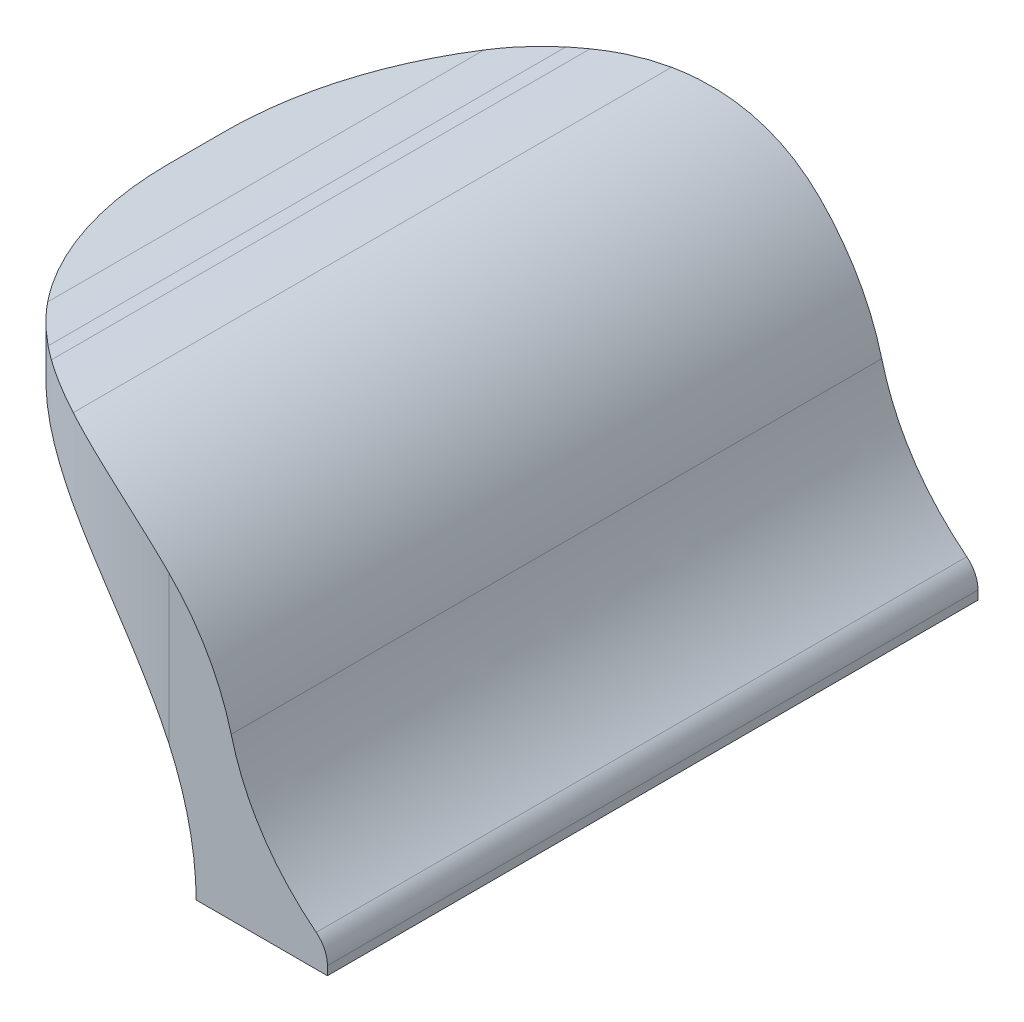
ISO-10303-21;
HEADER;
FILE_DESCRIPTION(('STEP AP214'),'2;1');
FILE_NAME('part.step','',(''),(''),'','','');
FILE_SCHEMA(('AUTOMOTIVE_DESIGN { 1 0 10303 214 1 1 1 1 }'));
ENDSEC;
DATA;
#1=APPLICATION_CONTEXT('core data for automotive mechanical design processes');
#2=APPLICATION_PROTOCOL_DEFINITION('international standard','automotive_design',2000,#1);
#3=PRODUCT_CONTEXT('',#1,'mechanical');
#4=PRODUCT('Part','Part','',(#3));
#5=PRODUCT_RELATED_PRODUCT_CATEGORY('part','',(#4));
#6=PRODUCT_DEFINITION_FORMATION('','',#4);
#7=PRODUCT_DEFINITION_CONTEXT('part definition',#1,'design');
#8=PRODUCT_DEFINITION('design','',#6,#7);
#9=PRODUCT_DEFINITION_SHAPE('','',#8);
#10=(LENGTH_UNIT() NAMED_UNIT(*) SI_UNIT(.MILLI.,.METRE.));
#11=(NAMED_UNIT(*) PLANE_ANGLE_UNIT() SI_UNIT($,.RADIAN.));
#12=(NAMED_UNIT(*) SI_UNIT($,.STERADIAN.) SOLID_ANGLE_UNIT());
#13=UNCERTAINTY_MEASURE_WITH_UNIT(LENGTH_MEASURE(1.E-05),#10,'distance_accuracy_value','');
#14=(GEOMETRIC_REPRESENTATION_CONTEXT(3) GLOBAL_UNCERTAINTY_ASSIGNED_CONTEXT((#13)) GLOBAL_UNIT_ASSIGNED_CONTEXT((#10,
#11,#12)) REPRESENTATION_CONTEXT('',''));
#15=CARTESIAN_POINT('',(0.,0.,0.));
#16=DIRECTION('',(0.,0.,1.));
#17=DIRECTION('',(1.,0.,0.));
#18=AXIS2_PLACEMENT_3D('',#15,#16,#17);
#19=CARTESIAN_POINT('',(19.2,114.3,9.53749999999998));
#20=DIRECTION('',(0.,1.,0.));
#21=DIRECTION('',(0.,0.,1.));
#22=AXIS2_PLACEMENT_3D('',#19,#20,#21);
#23=CYLINDRICAL_SURFACE('',#22,100.);
#24=CARTESIAN_POINT('',(19.2,124.098027477098,9.53749999999998));
#25=DIRECTION('',(-0.138620474093435,0.990345578150431,0.));
#26=DIRECTION('',(0.990345578150431,0.138620474093435,0.));
#27=AXIS2_PLACEMENT_3D('',#24,#25,#26);
#28=ELLIPSE('',#27,100.974853835123,100.);
#29=CARTESIAN_POINT('',(-80.8,110.100845366958,9.53749999999998));
#30=VERTEX_POINT('',#29);
#31=CARTESIAN_POINT('',(-57.6974039014432,113.334557815043,73.465500697803));
#32=VERTEX_POINT('',#31);
#33=EDGE_CURVE('E281',#30,#32,#28,.T.);
#34=ORIENTED_EDGE('',*,*,#33,.F.);
#35=DIRECTION('',(0.,-1.,0.));
#36=VECTOR('',#35,1.);
#37=CARTESIAN_POINT('',(-80.8,114.3,9.53749999999998));
#38=LINE('',#37,#36);
#39=CARTESIAN_POINT('',(-80.8,99.100845366958,9.53749999999998));
#40=VERTEX_POINT('',#39);
#41=EDGE_CURVE('E11',#40,#30,#38,.F.);
#42=ORIENTED_EDGE('',*,*,#41,.F.);
#43=CARTESIAN_POINT('',(19.2,99.100845366958,9.53749999999998));
#44=DIRECTION('',(0.,-1.,0.));
#45=DIRECTION('',(0.,0.,-1.));
#46=AXIS2_PLACEMENT_3D('',#43,#44,#45);
#47=CIRCLE('',#46,100.);
#48=CARTESIAN_POINT('',(-71.5919939481185,99.100845366958,51.4518631100941));
#49=VERTEX_POINT('',#48);
#50=EDGE_CURVE('E44',#49,#40,#47,.T.);
#51=ORIENTED_EDGE('',*,*,#50,.F.);
#52=CARTESIAN_POINT('',(19.2,41.0152084770521,109.5375));
#53=CARTESIAN_POINT('',(18.6741614627592,42.1542794539778,109.53747997094));
#54=CARTESIAN_POINT('',(18.1268527548087,43.2834582511904,109.53335178876));
#55=CARTESIAN_POINT('',(16.9901572620319,45.5204076394609,109.514701338181));
#56=CARTESIAN_POINT('',(16.4007685830404,46.6281772639623,109.500178601621));
#57=CARTESIAN_POINT('',(15.1805095562629,48.8211447425887,109.458550180805));
#58=CARTESIAN_POINT('',(14.5496180520067,49.9063307076043,109.43143803564));
#59=CARTESIAN_POINT('',(13.2476613297056,52.0518356797781,109.362320010504));
#60=CARTESIAN_POINT('',(12.5765965944647,53.112154985572,109.320314309495));
#61=CARTESIAN_POINT('',(11.1917222995404,55.2118645596623,109.218752433033));
#62=CARTESIAN_POINT('',(10.4777021741459,56.2511115192924,109.159103041211));
#63=CARTESIAN_POINT('',(9.01154915749051,58.3009863437433,109.019848664445));
#64=CARTESIAN_POINT('',(8.25941671514355,59.3116145454377,108.940243914505));
#65=CARTESIAN_POINT('',(6.71864601943419,61.3023539235825,108.758553387719));
#66=CARTESIAN_POINT('',(5.93001300016434,62.2824694419687,108.656470826294));
#67=CARTESIAN_POINT('',(4.31784811964813,64.2105604677322,108.427258972349));
#68=CARTESIAN_POINT('',(3.49431628523086,65.1585359998167,108.300129699083));
#69=CARTESIAN_POINT('',(1.81025953279753,67.0250433673817,108.017596185814));
#70=CARTESIAN_POINT('',(0.94957637027193,67.943412492772,107.86205947873));
#71=CARTESIAN_POINT('',(-0.802869811770035,69.7441629288867,107.520570380327));
#72=CARTESIAN_POINT('',(-1.69463287053923,70.6265441941566,107.334617950594));
#73=CARTESIAN_POINT('',(-3.50682240218988,72.3536694318312,106.929810806055));
#74=CARTESIAN_POINT('',(-4.4272507707138,73.1984109060919,106.710953911593));
#75=CARTESIAN_POINT('',(-6.29395581773209,74.8485719400711,106.237992412554));
#76=CARTESIAN_POINT('',(-7.24023240667354,75.6539916359957,105.983887930083));
#77=CARTESIAN_POINT('',(-9.15253958530255,77.2215093738131,105.439109584407));
#78=CARTESIAN_POINT('',(-10.118497477708,77.9837374936357,105.148555041224));
#79=CARTESIAN_POINT('',(-12.0698031852912,79.4663242553597,104.528275544874));
#80=CARTESIAN_POINT('',(-13.0551510969802,80.1866826887896,104.1985503967));
#81=CARTESIAN_POINT('',(-15.0415850588291,81.5843342858679,103.498251314142));
#82=CARTESIAN_POINT('',(-16.0426693919297,82.2616321078925,103.127681810274));
#83=CARTESIAN_POINT('',(-18.0569102078269,83.5723701492267,102.344235969684));
#84=CARTESIAN_POINT('',(-19.0700663891014,84.2058114612732,101.931360687697));
#85=CARTESIAN_POINT('',(-21.0087724998074,85.3707335663809,101.103098599629));
#86=CARTESIAN_POINT('',(-21.9335945874591,85.9061997941719,100.691604281624));
#87=CARTESIAN_POINT('',(-23.7868984710662,86.9404655998307,99.8324041135574));
#88=CARTESIAN_POINT('',(-24.7153801905512,87.43926593962,99.3846990163671));
#89=CARTESIAN_POINT('',(-26.5729027592415,88.4002006544621,98.4527464291365));
#90=CARTESIAN_POINT('',(-27.5019435772543,88.8623369128388,97.9685008185693));
#91=CARTESIAN_POINT('',(-29.3575685993916,89.7502317961565,96.9633311211311));
#92=CARTESIAN_POINT('',(-30.284152791524,90.1759902438355,96.4424068555548));
#93=CARTESIAN_POINT('',(-32.1321689148442,90.9917741168792,95.3637984252435));
#94=CARTESIAN_POINT('',(-33.0535987744152,91.3817860256651,94.806100491481));
#95=CARTESIAN_POINT('',(-34.8879847124428,92.1266249822243,93.6544585786707));
#96=CARTESIAN_POINT('',(-35.8009407766555,92.4814519708642,93.0605145387087));
#97=CARTESIAN_POINT('',(-37.6154999708213,93.1568663610931,91.8369314046915));
#98=CARTESIAN_POINT('',(-38.5171032295565,93.4774541513885,91.2072927159905));
#99=CARTESIAN_POINT('',(-40.3062319904975,94.0855483309866,89.9130394595691));
#100=CARTESIAN_POINT('',(-41.1937576257753,94.3730550331563,89.2484252227196));
#101=CARTESIAN_POINT('',(-42.90201474054,94.9008354879344,87.9239807249739));
#102=CARTESIAN_POINT('',(-43.7236690415266,95.142867776701,87.2660389138612));
#103=CARTESIAN_POINT('',(-45.3502359468801,95.5999846025013,85.9206204341985));
#104=CARTESIAN_POINT('',(-46.1551471323715,95.8150668633833,85.2331412775526));
#105=CARTESIAN_POINT('',(-47.7461720753239,96.2195895060928,83.8297280183304));
#106=CARTESIAN_POINT('',(-48.5322884232256,96.409033438551,83.1137978737096));
#107=CARTESIAN_POINT('',(-50.0841867503973,96.7637751813982,81.6543232096363));
#108=CARTESIAN_POINT('',(-50.8499669829841,96.9290709231355,80.910776331235));
#109=CARTESIAN_POINT('',(-52.3604109699794,97.2371842323039,79.3963052137768));
#110=CARTESIAN_POINT('',(-53.1050496540412,97.3799759574455,78.6253507281986));
#111=CARTESIAN_POINT('',(-54.570922851028,97.6444290220283,77.0578856878691));
#112=CARTESIAN_POINT('',(-55.2921555262755,97.7660887055763,76.2613731361927));
#113=CARTESIAN_POINT('',(-56.7098188695728,97.9898528914583,74.643995511682));
#114=CARTESIAN_POINT('',(-57.4062509550814,98.0919585128547,73.8231318355491));
#115=CARTESIAN_POINT('',(-58.7732406314476,98.2782392524911,72.1580570634366));
#116=CARTESIAN_POINT('',(-59.4437960741212,98.3624128846938,71.3138440390242));
#117=CARTESIAN_POINT('',(-60.8257957911845,98.5222794506484,69.5148951823825));
#118=CARTESIAN_POINT('',(-61.5343105270583,98.5961986687626,68.5577494951531));
#119=CARTESIAN_POINT('',(-62.9172393641279,98.7262990301502,66.6179511833568));
#120=CARTESIAN_POINT('',(-63.5916528447806,98.7824798507342,65.6352980951219));
#121=CARTESIAN_POINT('',(-64.9053805654351,98.8792153150163,63.6457826759724));
#122=CARTESIAN_POINT('',(-65.5446878947333,98.9197668914608,62.6389156341955));
#123=CARTESIAN_POINT('',(-66.787019785817,98.9872768356138,60.6027008630641));
#124=CARTESIAN_POINT('',(-67.3900468809774,99.0142361534145,59.5733547102374));
#125=CARTESIAN_POINT('',(-68.5574000088862,99.0564928945793,57.4963786858046));
#126=CARTESIAN_POINT('',(-69.1218261833697,99.0718216231246,56.4488057144003));
#127=CARTESIAN_POINT('',(-70.2129746455558,99.0928250774471,54.3341032918737));
#128=CARTESIAN_POINT('',(-70.7396966220015,99.0984997235363,53.2669736793983));
#129=CARTESIAN_POINT('',(-71.7545224539959,99.1020015538222,51.1150102387425));
#130=CARTESIAN_POINT('',(-72.2426413304929,99.0998318058762,50.0301834969224));
#131=CARTESIAN_POINT('',(-73.1798550446577,99.0893312353444,47.8438636190131));
#132=CARTESIAN_POINT('',(-73.6289509072217,99.0810005746229,46.7423709215295));
#133=CARTESIAN_POINT('',(-74.0582309006866,99.0704291176858,45.633238935146));
#134=B_SPLINE_CURVE_WITH_KNOTS('',3,(#52,#53,#54,#55,#56,#57,#58,#59,#60,#61,#62,#63,#64,#65,
#66,#67,#68,#69,#70,#71,#72,#73,#74,#75,#76,#77,#78,#79,#80,#81,#82,#83,#84,#85,#86,#87,#88,#89,
#90,#91,#92,#93,#94,#95,#96,#97,#98,#99,#100,#101,#102,#103,#104,#105,#106,#107,#108,#109,#110,
#111,#112,#113,#114,#115,#116,#117,#118,#119,#120,#121,#122,#123,#124,#125,#126,#127,#128,#129,
#130,#131,#132,#133),.UNSPECIFIED.,.F.,.F.,(4,2,2,2,2,2,2,2,2,2,2,2,2,2,2,2,2,2,2,2,2,2,2,2,2,2,
2,2,2,2,2,2,2,2,2,2,2,2,2,2,4),(0.,3.76355913018099,7.52728777811852,11.2929501176447,
15.0585672103232,18.8444456679216,22.6302795431078,26.4155722109432,30.2008619688206,
34.0042758301461,37.8076944952249,41.6113652174396,45.4150227632515,49.206538882553,
52.9980738784048,56.7891979986187,60.5802276244675,64.0145108951434,67.4487227808184,
70.8827581469592,74.3168102455319,77.7521555260586,81.1875065800898,84.622818629539,
88.0580981865549,91.2974794857448,94.5371341932131,97.7763397834937,101.015822697412,
104.258998955316,107.502429231898,110.745673834199,113.989187102107,117.567686571273,
121.146251135228,124.72551763861,128.304533918311,131.873882316756,135.443260177593,
139.011242244569,142.579130574109),.UNSPECIFIED.);
#135=CARTESIAN_POINT('',(19.2,41.0152084770521,109.5375));
#136=VERTEX_POINT('',#135);
#137=EDGE_CURVE('E257',#136,#49,#134,.T.);
#138=ORIENTED_EDGE('',*,*,#137,.F.);
#139=DIRECTION('',(0.,-1.,0.));
#140=VECTOR('',#139,1.);
#141=CARTESIAN_POINT('',(19.2,114.3,109.5375));
#142=LINE('',#141,#140);
#143=CARTESIAN_POINT('',(19.2,90.7791078814102,109.5375));
#144=VERTEX_POINT('',#143);
#145=EDGE_CURVE('E255',#144,#136,#142,.T.);
#146=ORIENTED_EDGE('',*,*,#145,.F.);
#147=CARTESIAN_POINT('',(19.2,90.7791078814102,109.5375));
#148=CARTESIAN_POINT('',(18.5202130921273,91.4565480266134,109.537504338115));
#149=CARTESIAN_POINT('',(17.8281979120944,92.1217511660535,109.530568487855));
#150=CARTESIAN_POINT('',(16.4208211667763,93.4267223665309,109.501350265641));
#151=CARTESIAN_POINT('',(15.705458076879,94.0664887604803,109.479066889579));
#152=CARTESIAN_POINT('',(14.2522479220946,95.3198271470562,109.417672848988));
#153=CARTESIAN_POINT('',(13.5143905803734,95.9333868498473,109.378554382715));
#154=CARTESIAN_POINT('',(12.0178254140151,97.1330075314257,109.282066679499));
#155=CARTESIAN_POINT('',(11.2591180113959,97.7190690661433,109.224697811707));
#156=CARTESIAN_POINT('',(9.72420741903608,98.8613120065329,109.090507595863));
#157=CARTESIAN_POINT('',(8.94805359521714,99.4175655666971,109.013736056588));
#158=CARTESIAN_POINT('',(7.37793366007412,100.500902648724,108.839376323395));
#159=CARTESIAN_POINT('',(6.58396773495534,101.027986475323,108.741788346997));
#160=CARTESIAN_POINT('',(4.98000791938419,102.052085884851,108.524603487627));
#161=CARTESIAN_POINT('',(4.17001683848171,102.549106677548,108.405010432623));
#162=CARTESIAN_POINT('',(2.53564535381388,103.512447981124,108.142693886054));
#163=CARTESIAN_POINT('',(1.71126496572333,103.978768525443,107.999970419683));
#164=CARTESIAN_POINT('',(0.0463180173828398,104.882076307237,107.689711862605));
#165=CARTESIAN_POINT('',(-0.794304042092636,105.318924548869,107.522069729253));
#166=CARTESIAN_POINT('',(-2.48615986171945,106.160497411484,107.161567423515));
#167=CARTESIAN_POINT('',(-3.33739363414582,106.565221995305,106.968707221956));
#168=CARTESIAN_POINT('',(-5.04845147055286,107.342199518451,106.557018407651));
#169=CARTESIAN_POINT('',(-5.90827624137656,107.714449760948,106.338187641735));
#170=CARTESIAN_POINT('',(-7.63429040364435,108.42621171548,105.873990991297));
#171=CARTESIAN_POINT('',(-8.50047978842307,108.765723461797,105.628625134559));
#172=CARTESIAN_POINT('',(-10.2370716024451,109.411957593196,105.110926155075));
#173=CARTESIAN_POINT('',(-11.1074742304076,109.718678415616,104.838591748325));
#174=CARTESIAN_POINT('',(-12.8502504925608,110.299416656361,104.266706276425));
#175=CARTESIAN_POINT('',(-13.7226241385525,110.573433878349,103.967155047898));
#176=CARTESIAN_POINT('',(-15.4670500760482,111.089009797836,103.340774960664));
#177=CARTESIAN_POINT('',(-16.3391023921306,111.33057200929,103.01394906125));
#178=CARTESIAN_POINT('',(-18.0808270798955,111.781717457768,102.333050637281));
#179=CARTESIAN_POINT('',(-18.9504994714846,111.991300963082,101.978978341352));
#180=CARTESIAN_POINT('',(-20.6475922124841,112.370654521411,101.259805757761));
#181=CARTESIAN_POINT('',(-21.4752029033705,112.541761154495,100.895857663612));
#182=CARTESIAN_POINT('',(-23.1246873263136,112.855967562667,100.14347461573));
#183=CARTESIAN_POINT('',(-23.9465604811957,112.99906455815,99.7550372367961));
#184=CARTESIAN_POINT('',(-25.5829137931433,113.258031539679,98.9540562807618));
#185=CARTESIAN_POINT('',(-26.3973931736628,113.373898696948,98.5415102046782));
#186=CARTESIAN_POINT('',(-28.0173301864604,113.579285364937,97.6928167515513));
#187=CARTESIAN_POINT('',(-28.8227877150865,113.668804573245,97.2566691036846));
#188=CARTESIAN_POINT('',(-30.424586655763,113.822615523785,96.3605615480659));
#189=CARTESIAN_POINT('',(-31.220910301923,113.886864248328,95.9005625316468));
#190=CARTESIAN_POINT('',(-32.8017394063708,113.99099824805,94.9580246550681));
#191=CARTESIAN_POINT('',(-33.5862445818287,114.030882941069,94.47548525662));
#192=CARTESIAN_POINT('',(-35.1417971233366,114.08741552957,93.4887763346163));
#193=CARTESIAN_POINT('',(-35.9128512508498,114.104075452516,92.9846181463768));
#194=CARTESIAN_POINT('',(-37.4407905651472,114.115403513611,91.9551567177936));
#195=CARTESIAN_POINT('',(-38.1976769069697,114.110073452422,91.4298552122698));
#196=CARTESIAN_POINT('',(-38.9469787750804,114.094352770222,90.8942997117042));
#197=B_SPLINE_CURVE_WITH_KNOTS('',3,(#147,#148,#149,#150,#151,#152,#153,#154,#155,#156,#157,
#158,#159,#160,#161,#162,#163,#164,#165,#166,#167,#168,#169,#170,#171,#172,#173,#174,#175,#176,
#177,#178,#179,#180,#181,#182,#183,#184,#185,#186,#187,#188,#189,#190,#191,#192,#193,#194,#195,
#196),.UNSPECIFIED.,.F.,.F.,(4,2,2,2,2,2,2,2,2,2,2,2,2,2,2,2,2,2,2,2,2,2,2,2,4),(0.,
2.87897258839763,5.75813355055138,8.63863021703896,11.5190686234211,14.3921864335047,
17.2652742223844,20.1378626850598,23.0104480187148,25.8957501323167,28.7810555837839,
31.666600417589,34.5521422299254,37.4378214924114,40.3235180783373,43.2089019731876,
46.0942616592412,48.853937050891,51.6138861668529,54.3741218741319,57.134389261301,
59.8993352954738,62.6643473933107,65.4279270356691,68.191280385326),.UNSPECIFIED.);
#198=CARTESIAN_POINT('',(-21.8276742008499,112.607430583888,100.733607097117));
#199=VERTEX_POINT('',#198);
#200=EDGE_CURVE('E246',#199,#144,#197,.F.);
#201=ORIENTED_EDGE('',*,*,#200,.F.);
#202=CARTESIAN_POINT('',(-21.8276742008499,112.607430583888,100.733607097117));
#203=CARTESIAN_POINT('',(-22.356148031028,112.711395974344,100.495856767829));
#204=CARTESIAN_POINT('',(-22.8833763571514,112.810186244688,100.253139615465));
#205=CARTESIAN_POINT('',(-23.9349908983102,112.997602729697,99.757843213585));
#206=CARTESIAN_POINT('',(-24.4593771525639,113.086229084958,99.5052641005533));
#207=CARTESIAN_POINT('',(-26.0275673711589,113.337113537106,98.7329299035892));
#208=CARTESIAN_POINT('',(-27.0666059165291,113.484416784093,98.1984866451902));
#209=CARTESIAN_POINT('',(-29.1204513584453,113.739728403422,97.0959466850743));
#210=CARTESIAN_POINT('',(-30.1353867922064,113.848047572927,96.5281601348855));
#211=CARTESIAN_POINT('',(-32.1471940707358,114.028913580401,95.3560349641487));
#212=CARTESIAN_POINT('',(-33.1440656374582,114.101459868189,94.7516957815884));
#213=CARTESIAN_POINT('',(-35.1171375394895,114.212771062521,93.5077826345133));
#214=CARTESIAN_POINT('',(-36.0933428330555,114.251544163646,92.8682172571977));
#215=CARTESIAN_POINT('',(-38.023285833471,114.29748398051,91.5549253798686));
#216=CARTESIAN_POINT('',(-38.9770227990084,114.304649654853,90.8811977550232));
#217=CARTESIAN_POINT('',(-40.8679358433454,114.289550679003,89.4951656745019));
#218=CARTESIAN_POINT('',(-41.8049094869224,114.267041923505,88.782588056432));
#219=CARTESIAN_POINT('',(-43.6523760557229,114.194556870401,87.3254429202009));
#220=CARTESIAN_POINT('',(-44.562872208469,114.144583935496,86.5808793286715));
#221=CARTESIAN_POINT('',(-45.4593840838378,114.082070096935,85.8209454511511));
#222=B_SPLINE_CURVE_WITH_KNOTS('',3,(#202,#203,#204,#205,#206,#207,#208,#209,#210,#211,#212,
#213,#214,#215,#216,#217,#218,#219,#220,#221),.UNSPECIFIED.,.F.,.F.,(4,2,2,2,2,2,2,2,2,4),(0.,
1.76613412398454,3.53224381438137,7.06378524185359,10.566513191129,14.0692950100382,
17.571226691956,21.0732737540233,24.6043095823433,28.1349131688141),.UNSPECIFIED.);
#223=CARTESIAN_POINT('',(-39.2,114.3,90.7128657213812));
#224=VERTEX_POINT('',#223);
#225=EDGE_CURVE('E238',#224,#199,#222,.F.);
#226=ORIENTED_EDGE('',*,*,#225,.F.);
#227=CARTESIAN_POINT('',(19.2,114.3,9.53749999999998));
#228=DIRECTION('',(0.,1.,0.));
#229=DIRECTION('',(0.,0.,1.));
#230=AXIS2_PLACEMENT_3D('',#227,#228,#229);
#231=CIRCLE('',#230,100.);
#232=CARTESIAN_POINT('',(-43.8353564920997,114.3,87.1683175399042));
#233=VERTEX_POINT('',#232);
#234=EDGE_CURVE('E247',#233,#224,#231,.T.);
#235=ORIENTED_EDGE('',*,*,#234,.F.);
#236=CARTESIAN_POINT('',(-43.8353564920997,114.3,87.1683175399042));
#237=CARTESIAN_POINT('',(-44.9065196832462,114.300010091943,86.2985890110179));
#238=CARTESIAN_POINT('',(-45.9595679937707,114.282790050415,85.4066975414454));
#239=CARTESIAN_POINT('',(-48.0272011154415,114.217453659481,83.5807547946442));
#240=CARTESIAN_POINT('',(-49.041791631594,114.169341911839,82.6467098160513));
#241=CARTESIAN_POINT('',(-51.0231305522016,114.046247736835,80.7455290112895));
#242=CARTESIAN_POINT('',(-51.990180936398,113.971469744342,79.7786942453767));
#243=CARTESIAN_POINT('',(-53.8828602423095,113.7984959842,77.8072785655958));
#244=CARTESIAN_POINT('',(-54.8084878830435,113.700299492937,76.8026964861726));
#245=CARTESIAN_POINT('',(-56.6166283386083,113.484010882362,74.7579048061169));
#246=CARTESIAN_POINT('',(-57.4991497350204,113.365922744071,73.717702367498));
#247=CARTESIAN_POINT('',(-59.2199943953511,113.11330468505,71.603292120494));
#248=CARTESIAN_POINT('',(-60.0583172169142,112.978774599809,70.5290839719394));
#249=CARTESIAN_POINT('',(-61.6958060004405,112.695630610092,68.3401434451207));
#250=CARTESIAN_POINT('',(-62.4946256820544,112.546917377193,67.2251650046771));
#251=CARTESIAN_POINT('',(-64.045117042995,112.239724693752,64.9642959176506));
#252=CARTESIAN_POINT('',(-64.7967915285674,112.081245825611,63.8184071167771));
#253=CARTESIAN_POINT('',(-65.5243933508917,111.919596803808,62.6579025899971));
#254=B_SPLINE_CURVE_WITH_KNOTS('',3,(#236,#237,#238,#239,#240,#241,#242,#243,#244,#245,#246,
#247,#248,#249,#250,#251,#252,#253),.UNSPECIFIED.,.F.,.F.,(4,2,2,2,2,2,2,2,4),(0.,
4.13883054569092,8.27704469599859,12.384192472281,16.4914671727625,20.5979208371334,
24.7044155926067,28.8421408081245,32.9796194976741),.UNSPECIFIED.);
#255=EDGE_CURVE('E350',#32,#233,#254,.F.);
#256=ORIENTED_EDGE('',*,*,#255,.F.);
#257=EDGE_LOOP('',(#34,#42,#51,#138,#146,#201,#226,#235,#256));
#258=FACE_BOUND('',#257,.T.);
#259=ADVANCED_FACE('F36',(#258),#23,.T.);
#260=CARTESIAN_POINT('',(19.2,114.3,-9.53750000000003));
#261=DIRECTION('',(0.,-1.,0.));
#262=DIRECTION('',(0.,0.,-1.));
#263=AXIS2_PLACEMENT_3D('',#260,#261,#262);
#264=CYLINDRICAL_SURFACE('',#263,100.);
#265=DIRECTION('',(0.,1.,0.));
#266=VECTOR('',#265,1.);
#267=CARTESIAN_POINT('',(19.2,114.3,-109.5375));
#268=LINE('',#267,#266);
#269=CARTESIAN_POINT('',(19.2,41.0152084770521,-109.5375));
#270=VERTEX_POINT('',#269);
#271=CARTESIAN_POINT('',(19.2,90.7791078814102,-109.5375));
#272=VERTEX_POINT('',#271);
#273=EDGE_CURVE('E334',#270,#272,#268,.T.);
#274=ORIENTED_EDGE('',*,*,#273,.F.);
#275=CARTESIAN_POINT('',(-71.5919939481185,99.100845366958,-51.4518631100942));
#276=CARTESIAN_POINT('',(-71.0661554108777,99.1008253378979,-52.5909340870199));
#277=CARTESIAN_POINT('',(-70.5188467029272,99.0966971557182,-53.7201128842325));
#278=CARTESIAN_POINT('',(-69.3821512101503,99.0780467051389,-55.957062272503));
#279=CARTESIAN_POINT('',(-68.7927625311589,99.0635239685786,-57.0648318970043));
#280=CARTESIAN_POINT('',(-67.5725035043813,99.0218955477632,-59.2577993756308));
#281=CARTESIAN_POINT('',(-66.9416120001252,98.9947834025982,-60.3429853406464));
#282=CARTESIAN_POINT('',(-65.6396552778241,98.925665377462,-62.4884903128202));
#283=CARTESIAN_POINT('',(-64.9685905425831,98.8836596764526,-63.5488096186141));
#284=CARTESIAN_POINT('',(-63.5837162476588,98.7820977999913,-65.6485191927043));
#285=CARTESIAN_POINT('',(-62.8696961222644,98.7224484081692,-66.6877661523345));
#286=CARTESIAN_POINT('',(-61.403543105609,98.5831940314027,-68.7376409767854));
#287=CARTESIAN_POINT('',(-60.651410663262,98.5035892814632,-69.7482691784798));
#288=CARTESIAN_POINT('',(-59.1106399675526,98.3218987546766,-71.7390085566246));
#289=CARTESIAN_POINT('',(-58.3220069482828,98.219816193252,-72.7191240750107));
#290=CARTESIAN_POINT('',(-56.7098420677666,97.9906043393068,-74.6472151007742));
#291=CARTESIAN_POINT('',(-55.8863102333493,97.8634750660411,-75.5951906328587));
#292=CARTESIAN_POINT('',(-54.2022534809159,97.5809415527725,-77.4616980004238));
#293=CARTESIAN_POINT('',(-53.3415703183903,97.4254048456875,-78.380067125814));
#294=CARTESIAN_POINT('',(-51.5891241363484,97.0839157472846,-80.1808175619287));
#295=CARTESIAN_POINT('',(-50.6973610775792,96.8979633175515,-81.0631988271987));
#296=CARTESIAN_POINT('',(-48.8851715459285,96.4931561730134,-82.7903240648733));
#297=CARTESIAN_POINT('',(-47.9647431774046,96.2742992785509,-83.6350655391339));
#298=CARTESIAN_POINT('',(-46.0980381303863,95.801337779512,-85.2852265731132));
#299=CARTESIAN_POINT('',(-45.1517615414449,95.5472332970407,-86.0906462690378));
#300=CARTESIAN_POINT('',(-43.2394543628159,95.0024549513649,-87.6581640068551));
#301=CARTESIAN_POINT('',(-42.2734964704104,94.7119004081821,-88.4203921266777));
#302=CARTESIAN_POINT('',(-40.3221907628273,94.0916209118323,-89.9029788884017));
#303=CARTESIAN_POINT('',(-39.3368428511382,93.7618957636576,-90.6233373218316));
#304=CARTESIAN_POINT('',(-37.3504088892893,93.0615966811002,-92.02098891891));
#305=CARTESIAN_POINT('',(-36.3493245561888,92.6910271772323,-92.6982867409345));
#306=CARTESIAN_POINT('',(-34.3350837402915,91.9075813366424,-94.0090247822688));
#307=CARTESIAN_POINT('',(-33.321927559017,91.4947060546551,-94.6424660943153));
#308=CARTESIAN_POINT('',(-31.383221448311,90.6664439665866,-95.8073881994229));
#309=CARTESIAN_POINT('',(-30.4583993606593,90.2549496485815,-96.3428544272139));
#310=CARTESIAN_POINT('',(-28.6050954770523,89.3957494805155,-97.3771202328727));
#311=CARTESIAN_POINT('',(-27.6766137575673,88.9480443833251,-97.875920572662));
#312=CARTESIAN_POINT('',(-25.8190911888769,88.0160917960945,-98.8368552875042));
#313=CARTESIAN_POINT('',(-24.8900503708641,87.5318461855273,-99.2989915458809));
#314=CARTESIAN_POINT('',(-23.0344253487269,86.5266764880892,-100.186886429199));
#315=CARTESIAN_POINT('',(-22.1078411565945,86.0057522225128,-100.612644876878));
#316=CARTESIAN_POINT('',(-20.2598250332742,84.9271437922015,-101.428428749921));
#317=CARTESIAN_POINT('',(-19.3383951737032,84.369445858439,-101.818440658707));
#318=CARTESIAN_POINT('',(-17.5040092356757,83.2178039456287,-102.563279615266));
#319=CARTESIAN_POINT('',(-16.5910531714629,82.6238599056666,-102.918106603906));
#320=CARTESIAN_POINT('',(-14.7764939772971,81.4002767716495,-103.593520994135));
#321=CARTESIAN_POINT('',(-13.874890718562,80.7706380829485,-103.914108784431));
#322=CARTESIAN_POINT('',(-12.0857619576209,79.4763848265271,-104.522202964029));
#323=CARTESIAN_POINT('',(-11.1982363223432,78.8117705896776,-104.809709666198));
#324=CARTESIAN_POINT('',(-9.48997920757842,77.4873260919319,-105.337490120976));
#325=CARTESIAN_POINT('',(-8.66832490659188,76.8293842808192,-105.579522409743));
#326=CARTESIAN_POINT('',(-7.04175800123838,75.4839658011565,-106.036639235543));
#327=CARTESIAN_POINT('',(-6.23684681574699,74.7964866445106,-106.251721496425));
#328=CARTESIAN_POINT('',(-4.6458218727945,73.3930733852884,-106.656244139135));
#329=CARTESIAN_POINT('',(-3.85970552489286,72.6771432406676,-106.845688071593));
#330=CARTESIAN_POINT('',(-2.30780719772119,71.2176685765943,-107.20042981444));
#331=CARTESIAN_POINT('',(-1.54202696513431,70.474121698193,-107.365725556178));
#332=CARTESIAN_POINT('',(-0.0315829781390652,68.9596505807347,-107.673838865346));
#333=CARTESIAN_POINT('',(0.713055705922775,68.1886960951566,-107.816630590488));
#334=CARTESIAN_POINT('',(2.17892890290955,66.6212310548271,-108.08108365507));
#335=CARTESIAN_POINT('',(2.90016157815708,65.8247185031507,-108.202743338618));
#336=CARTESIAN_POINT('',(4.31782492145438,64.2073408786401,-108.4265075245));
#337=CARTESIAN_POINT('',(5.01425700696295,63.3864772025071,-108.528613145897));
#338=CARTESIAN_POINT('',(6.38124668332918,61.7214024303946,-108.714893885533));
#339=CARTESIAN_POINT('',(7.05180212600274,60.8771894059822,-108.799067517736));
#340=CARTESIAN_POINT('',(8.43380184306606,59.0782405493405,-108.95893408369));
#341=CARTESIAN_POINT('',(9.14231657893989,58.1210948621111,-109.032853301805));
#342=CARTESIAN_POINT('',(10.5252454160094,56.1812965503148,-109.162953663192));
#343=CARTESIAN_POINT('',(11.1996588966622,55.1986434620799,-109.219134483776));
#344=CARTESIAN_POINT('',(12.5133866173166,53.2091280429304,-109.315869948058));
#345=CARTESIAN_POINT('',(13.1526939466149,52.2022610011536,-109.356421524503));
#346=CARTESIAN_POINT('',(14.3950258376986,50.1660462300221,-109.423931468656));
#347=CARTESIAN_POINT('',(14.9980529328589,49.1367000771954,-109.450890786457));
#348=CARTESIAN_POINT('',(16.1654060607678,47.0597240527626,-109.493147527621));
#349=CARTESIAN_POINT('',(16.7298322352513,46.0121510813583,-109.508476256167));
#350=CARTESIAN_POINT('',(17.8209806974374,43.8974486588317,-109.529479710489));
#351=CARTESIAN_POINT('',(18.3477026738831,42.8303190463563,-109.535154356578));
#352=CARTESIAN_POINT('',(19.3625285058775,40.6783556057005,-109.538656186864));
#353=CARTESIAN_POINT('',(19.8506473823744,39.5935288638804,-109.536486438918));
#354=CARTESIAN_POINT('',(20.7878610965392,37.4072089859711,-109.525985868386));
#355=CARTESIAN_POINT('',(21.2369569591032,36.3057162884875,-109.517655207665));
#356=CARTESIAN_POINT('',(21.6662369525682,35.196584302104,-109.507083750728));
#357=B_SPLINE_CURVE_WITH_KNOTS('',3,(#275,#276,#277,#278,#279,#280,#281,#282,#283,#284,#285,
#286,#287,#288,#289,#290,#291,#292,#293,#294,#295,#296,#297,#298,#299,#300,#301,#302,#303,#304,
#305,#306,#307,#308,#309,#310,#311,#312,#313,#314,#315,#316,#317,#318,#319,#320,#321,#322,#323,
#324,#325,#326,#327,#328,#329,#330,#331,#332,#333,#334,#335,#336,#337,#338,#339,#340,#341,#342,
#343,#344,#345,#346,#347,#348,#349,#350,#351,#352,#353,#354,#355,#356),.UNSPECIFIED.,.F.,.F.,(4,
2,2,2,2,2,2,2,2,2,2,2,2,2,2,2,2,2,2,2,2,2,2,2,2,2,2,2,2,2,2,2,2,2,2,2,2,2,2,2,4),(0.,
3.76355913018099,7.52728777811853,11.2929501176447,15.0585672103231,18.8444456679216,
22.6302795431078,26.4155722109432,30.2008619688206,34.0042758301461,37.8076944952249,
41.6113652174397,45.4150227632515,49.2065388825529,52.9980738784048,56.7891979986187,
60.5802276244675,64.0145108951434,67.4487227808184,70.8827581469591,74.3168102455319,
77.7521555260586,81.1875065800897,84.6228186295389,88.0580981865549,91.2974794857448,
94.537134193213,97.7763397834936,101.015822697412,104.258998955316,107.502429231898,
110.745673834199,113.989187102107,117.567686571273,121.146251135227,124.72551763861,
128.304533918311,131.873882316756,135.443260177593,139.011242244569,142.579130574109),.UNSPECIFIED.);
#358=CARTESIAN_POINT('',(-71.5919939481185,99.100845366958,-51.4518631100942));
#359=VERTEX_POINT('',#358);
#360=EDGE_CURVE('E274',#359,#270,#357,.T.);
#361=ORIENTED_EDGE('',*,*,#360,.F.);
#362=CARTESIAN_POINT('',(19.2,99.100845366958,-9.53750000000003));
#363=DIRECTION('',(0.,-1.,0.));
#364=DIRECTION('',(0.,0.,-1.));
#365=AXIS2_PLACEMENT_3D('',#362,#363,#364);
#366=CIRCLE('',#365,100.);
#367=CARTESIAN_POINT('',(-80.8,99.100845366958,-9.53750000000003));
#368=VERTEX_POINT('',#367);
#369=EDGE_CURVE('E282',#368,#359,#366,.T.);
#370=ORIENTED_EDGE('',*,*,#369,.F.);
#371=DIRECTION('',(0.,1.,0.));
#372=VECTOR('',#371,1.);
#373=CARTESIAN_POINT('',(-80.8,114.3,-9.53750000000003));
#374=LINE('',#373,#372);
#375=CARTESIAN_POINT('',(-80.8,110.100845366958,-9.53750000000003));
#376=VERTEX_POINT('',#375);
#377=EDGE_CURVE('E307',#376,#368,#374,.F.);
#378=ORIENTED_EDGE('',*,*,#377,.F.);
#379=CARTESIAN_POINT('',(19.2,124.098027477098,-9.53750000000003));
#380=DIRECTION('',(-0.138620474093435,0.990345578150431,0.));
#381=DIRECTION('',(-0.990345578150431,-0.138620474093435,0.));
#382=AXIS2_PLACEMENT_3D('',#379,#380,#381);
#383=ELLIPSE('',#382,100.974853835123,100.);
#384=CARTESIAN_POINT('',(-57.6974039014432,113.334557815043,-73.4655006978031));
#385=VERTEX_POINT('',#384);
#386=EDGE_CURVE('E304',#385,#376,#383,.T.);
#387=ORIENTED_EDGE('',*,*,#386,.F.);
#388=CARTESIAN_POINT('',(-43.8353564920997,114.3,-87.1683175399042));
#389=CARTESIAN_POINT('',(-44.9065196832462,114.300010091943,-86.298589011018));
#390=CARTESIAN_POINT('',(-45.9595679937707,114.282790050415,-85.4066975414455));
#391=CARTESIAN_POINT('',(-48.0272011154415,114.217453659481,-83.5807547946443));
#392=CARTESIAN_POINT('',(-49.041791631594,114.169341911839,-82.6467098160514));
#393=CARTESIAN_POINT('',(-51.0231305522016,114.046247736835,-80.7455290112896));
#394=CARTESIAN_POINT('',(-51.990180936398,113.971469744342,-79.7786942453767));
#395=CARTESIAN_POINT('',(-53.8828602423095,113.7984959842,-77.8072785655958));
#396=CARTESIAN_POINT('',(-54.8084878830435,113.700299492937,-76.8026964861726));
#397=CARTESIAN_POINT('',(-56.6166283386083,113.484010882362,-74.757904806117));
#398=CARTESIAN_POINT('',(-57.4991497350204,113.365922744071,-73.7177023674981));
#399=CARTESIAN_POINT('',(-59.2199943953511,113.11330468505,-71.6032921204941));
#400=CARTESIAN_POINT('',(-60.0583172169142,112.978774599809,-70.5290839719394));
#401=CARTESIAN_POINT('',(-61.6958060004405,112.695630610092,-68.3401434451207));
#402=CARTESIAN_POINT('',(-62.4946256820544,112.546917377193,-67.2251650046772));
#403=CARTESIAN_POINT('',(-64.045117042995,112.239724693752,-64.9642959176506));
#404=CARTESIAN_POINT('',(-64.7967915285674,112.081245825611,-63.8184071167771));
#405=CARTESIAN_POINT('',(-65.5243933508917,111.919596803808,-62.6579025899972));
#406=B_SPLINE_CURVE_WITH_KNOTS('',3,(#388,#389,#390,#391,#392,#393,#394,#395,#396,#397,#398,
#399,#400,#401,#402,#403,#404,#405),.UNSPECIFIED.,.F.,.F.,(4,2,2,2,2,2,2,2,4),(0.,
4.13883054569092,8.27704469599859,12.384192472281,16.4914671727625,20.5979208371334,
24.7044155926067,28.8421408081245,32.9796194976741),.UNSPECIFIED.);
#407=CARTESIAN_POINT('',(-43.8353564920997,114.3,-87.1683175399042));
#408=VERTEX_POINT('',#407);
#409=EDGE_CURVE('E297',#408,#385,#406,.T.);
#410=ORIENTED_EDGE('',*,*,#409,.F.);
#411=CARTESIAN_POINT('',(19.2,114.3,-9.53750000000003));
#412=DIRECTION('',(0.,1.,0.));
#413=DIRECTION('',(0.,0.,1.));
#414=AXIS2_PLACEMENT_3D('',#411,#412,#413);
#415=CIRCLE('',#414,100.);
#416=CARTESIAN_POINT('',(-39.2,114.3,-90.7128657213813));
#417=VERTEX_POINT('',#416);
#418=EDGE_CURVE('E305',#417,#408,#415,.T.);
#419=ORIENTED_EDGE('',*,*,#418,.F.);
#420=CARTESIAN_POINT('',(-21.8276742008499,112.607430583888,-100.733607097117));
#421=CARTESIAN_POINT('',(-22.356148031028,112.711395974344,-100.495856767829));
#422=CARTESIAN_POINT('',(-22.8833763571514,112.810186244688,-100.253139615465));
#423=CARTESIAN_POINT('',(-23.9349908983102,112.997602729697,-99.7578432135851));
#424=CARTESIAN_POINT('',(-24.4593771525639,113.086229084958,-99.5052641005533));
#425=CARTESIAN_POINT('',(-26.0275673711589,113.337113537106,-98.7329299035892));
#426=CARTESIAN_POINT('',(-27.0666059165291,113.484416784093,-98.1984866451903));
#427=CARTESIAN_POINT('',(-29.1204513584453,113.739728403422,-97.0959466850744));
#428=CARTESIAN_POINT('',(-30.1353867922064,113.848047572927,-96.5281601348855));
#429=CARTESIAN_POINT('',(-32.1471940707358,114.028913580401,-95.3560349641487));
#430=CARTESIAN_POINT('',(-33.1440656374582,114.101459868189,-94.7516957815885));
#431=CARTESIAN_POINT('',(-35.1171375394895,114.212771062521,-93.5077826345133));
#432=CARTESIAN_POINT('',(-36.0933428330555,114.251544163646,-92.8682172571978));
#433=CARTESIAN_POINT('',(-38.023285833471,114.29748398051,-91.5549253798686));
#434=CARTESIAN_POINT('',(-38.9770227990084,114.304649654853,-90.8811977550233));
#435=CARTESIAN_POINT('',(-40.8679358433454,114.289550679003,-89.495165674502));
#436=CARTESIAN_POINT('',(-41.8049094869224,114.267041923505,-88.782588056432));
#437=CARTESIAN_POINT('',(-43.6523760557229,114.194556870401,-87.3254429202009));
#438=CARTESIAN_POINT('',(-44.562872208469,114.144583935496,-86.5808793286715));
#439=CARTESIAN_POINT('',(-45.4593840838378,114.082070096935,-85.8209454511511));
#440=B_SPLINE_CURVE_WITH_KNOTS('',3,(#420,#421,#422,#423,#424,#425,#426,#427,#428,#429,#430,
#431,#432,#433,#434,#435,#436,#437,#438,#439),.UNSPECIFIED.,.F.,.F.,(4,2,2,2,2,2,2,2,2,4),(0.,
1.76613412398454,3.53224381438137,7.06378524185359,10.566513191129,14.0692950100382,
17.571226691956,21.0732737540233,24.6043095823433,28.1349131688141),.UNSPECIFIED.);
#441=CARTESIAN_POINT('',(-21.8276742008499,112.607430583888,-100.733607097117));
#442=VERTEX_POINT('',#441);
#443=EDGE_CURVE('E230',#442,#417,#440,.T.);
#444=ORIENTED_EDGE('',*,*,#443,.F.);
#445=CARTESIAN_POINT('',(19.2,90.7791078814102,-109.5375));
#446=CARTESIAN_POINT('',(18.5202130921273,91.4565480266134,-109.537504338115));
#447=CARTESIAN_POINT('',(17.8281979120944,92.1217511660535,-109.530568487855));
#448=CARTESIAN_POINT('',(16.4208211667763,93.426722366531,-109.501350265641));
#449=CARTESIAN_POINT('',(15.705458076879,94.0664887604804,-109.479066889579));
#450=CARTESIAN_POINT('',(14.2522479220946,95.3198271470562,-109.417672848988));
#451=CARTESIAN_POINT('',(13.5143905803734,95.9333868498473,-109.378554382715));
#452=CARTESIAN_POINT('',(12.0178254140151,97.1330075314257,-109.282066679499));
#453=CARTESIAN_POINT('',(11.2591180113959,97.7190690661433,-109.224697811707));
#454=CARTESIAN_POINT('',(9.72420741903607,98.8613120065329,-109.090507595863));
#455=CARTESIAN_POINT('',(8.94805359521712,99.4175655666971,-109.013736056588));
#456=CARTESIAN_POINT('',(7.37793366007409,100.500902648724,-108.839376323395));
#457=CARTESIAN_POINT('',(6.58396773495531,101.027986475323,-108.741788346997));
#458=CARTESIAN_POINT('',(4.98000791938417,102.052085884851,-108.524603487627));
#459=CARTESIAN_POINT('',(4.1700168384817,102.549106677548,-108.405010432623));
#460=CARTESIAN_POINT('',(2.53564535381386,103.512447981124,-108.142693886054));
#461=CARTESIAN_POINT('',(1.7112649657233,103.978768525443,-107.999970419683));
#462=CARTESIAN_POINT('',(0.0463180173828067,104.882076307237,-107.689711862606));
#463=CARTESIAN_POINT('',(-0.794304042092667,105.318924548869,-107.522069729253));
#464=CARTESIAN_POINT('',(-2.48615986171948,106.160497411484,-107.161567423515));
#465=CARTESIAN_POINT('',(-3.33739363414586,106.565221995305,-106.968707221956));
#466=CARTESIAN_POINT('',(-5.04845147055289,107.342199518451,-106.557018407651));
#467=CARTESIAN_POINT('',(-5.90827624137658,107.714449760948,-106.338187641735));
#468=CARTESIAN_POINT('',(-7.63429040364437,108.42621171548,-105.873990991297));
#469=CARTESIAN_POINT('',(-8.5004797884231,108.765723461797,-105.628625134559));
#470=CARTESIAN_POINT('',(-10.2370716024452,109.411957593196,-105.110926155075));
#471=CARTESIAN_POINT('',(-11.1074742304076,109.718678415616,-104.838591748325));
#472=CARTESIAN_POINT('',(-12.8502504925608,110.299416656361,-104.266706276425));
#473=CARTESIAN_POINT('',(-13.7226241385525,110.573433878349,-103.967155047898));
#474=CARTESIAN_POINT('',(-15.4670500760482,111.089009797836,-103.340774960664));
#475=CARTESIAN_POINT('',(-16.3391023921306,111.33057200929,-103.01394906125));
#476=CARTESIAN_POINT('',(-18.0808270798955,111.781717457768,-102.333050637281));
#477=CARTESIAN_POINT('',(-18.9504994714846,111.991300963082,-101.978978341352));
#478=CARTESIAN_POINT('',(-20.6475922124842,112.370654521411,-101.259805757761));
#479=CARTESIAN_POINT('',(-21.4752029033705,112.541761154495,-100.895857663612));
#480=CARTESIAN_POINT('',(-23.1246873263136,112.855967562667,-100.14347461573));
#481=CARTESIAN_POINT('',(-23.9465604811957,112.99906455815,-99.7550372367961));
#482=CARTESIAN_POINT('',(-25.5829137931434,113.258031539679,-98.9540562807619));
#483=CARTESIAN_POINT('',(-26.3973931736629,113.373898696948,-98.5415102046782));
#484=CARTESIAN_POINT('',(-28.0173301864605,113.579285364937,-97.6928167515513));
#485=CARTESIAN_POINT('',(-28.8227877150865,113.668804573245,-97.2566691036846));
#486=CARTESIAN_POINT('',(-30.424586655763,113.822615523785,-96.3605615480659));
#487=CARTESIAN_POINT('',(-31.220910301923,113.886864248328,-95.9005625316468));
#488=CARTESIAN_POINT('',(-32.8017394063709,113.99099824805,-94.9580246550681));
#489=CARTESIAN_POINT('',(-33.5862445818288,114.030882941069,-94.47548525662));
#490=CARTESIAN_POINT('',(-35.1417971233366,114.08741552957,-93.4887763346163));
#491=CARTESIAN_POINT('',(-35.9128512508498,114.104075452516,-92.9846181463768));
#492=CARTESIAN_POINT('',(-37.4407905651472,114.115403513611,-91.9551567177937));
#493=CARTESIAN_POINT('',(-38.1976769069697,114.110073452422,-91.4298552122699));
#494=CARTESIAN_POINT('',(-38.9469787750804,114.094352770222,-90.8942997117042));
#495=B_SPLINE_CURVE_WITH_KNOTS('',3,(#445,#446,#447,#448,#449,#450,#451,#452,#453,#454,#455,
#456,#457,#458,#459,#460,#461,#462,#463,#464,#465,#466,#467,#468,#469,#470,#471,#472,#473,#474,
#475,#476,#477,#478,#479,#480,#481,#482,#483,#484,#485,#486,#487,#488,#489,#490,#491,#492,#493,
#494),.UNSPECIFIED.,.F.,.F.,(4,2,2,2,2,2,2,2,2,2,2,2,2,2,2,2,2,2,2,2,2,2,2,2,4),(0.,
2.87897258839763,5.75813355055138,8.63863021703896,11.5190686234211,14.3921864335048,
17.2652742223845,20.1378626850598,23.0104480187148,25.8957501323168,28.781055583784,
31.666600417589,34.5521422299254,37.4378214924114,40.3235180783373,43.2089019731876,
46.0942616592412,48.8539370508911,51.6138861668529,54.3741218741319,57.134389261301,
59.8993352954738,62.6643473933107,65.4279270356691,68.191280385326),.UNSPECIFIED.);
#496=EDGE_CURVE('E289',#272,#442,#495,.T.);
#497=ORIENTED_EDGE('',*,*,#496,.F.);
#498=EDGE_LOOP('',(#274,#361,#370,#378,#387,#410,#419,#444,#497));
#499=FACE_BOUND('',#498,.T.);
#500=ADVANCED_FACE('F221',(#499),#264,.T.);
#501=CARTESIAN_POINT('',(50.8,114.3,109.5375));
#502=DIRECTION('',(0.,0.,-1.));
#503=DIRECTION('',(-1.,0.,0.));
#504=AXIS2_PLACEMENT_3D('',#501,#502,#503);
#505=PLANE('',#504);
#506=CARTESIAN_POINT('',(-37.2697415778722,34.1119367315431,109.5375));
#507=DIRECTION('',(0.,0.,-1.));
#508=DIRECTION('',(-1.,0.,0.));
#509=AXIS2_PLACEMENT_3D('',#506,#507,#508);
#510=CIRCLE('',#509,80.);
#511=CARTESIAN_POINT('',(40.1668768059532,54.2009917933868,109.5375));
#512=VERTEX_POINT('',#511);
#513=EDGE_CURVE('E486',#512,#144,#510,.F.);
#514=ORIENTED_EDGE('',*,*,#513,.T.);
#515=ORIENTED_EDGE('',*,*,#145,.T.);
#516=CARTESIAN_POINT('',(-71.5919939481185,-0.899154633041993,109.5375));
#517=DIRECTION('',(0.,0.,-1.));
#518=DIRECTION('',(-1.,0.,0.));
#519=AXIS2_PLACEMENT_3D('',#516,#517,#518);
#520=CIRCLE('',#519,100.);
#521=CARTESIAN_POINT('',(28.4039635749028,0.,109.5375));
#522=VERTEX_POINT('',#521);
#523=EDGE_CURVE('E141',#136,#522,#520,.T.);
#524=ORIENTED_EDGE('',*,*,#523,.T.);
#525=DIRECTION('',(1.,0.,0.));
#526=VECTOR('',#525,1.);
#527=CARTESIAN_POINT('',(50.8,0.,109.5375));
#528=LINE('',#527,#526);
#529=CARTESIAN_POINT('',(72.5715062256728,0.,109.5375));
#530=VERTEX_POINT('',#529);
#531=EDGE_CURVE('E132',#522,#530,#528,.T.);
#532=ORIENTED_EDGE('',*,*,#531,.T.);
#533=DIRECTION('',(0.,1.,0.));
#534=VECTOR('',#533,1.);
#535=CARTESIAN_POINT('',(72.5715062256728,71.5344173266557,109.5375));
#536=LINE('',#535,#534);
#537=CARTESIAN_POINT('',(72.5715062256728,2.94846570432927,109.5375));
#538=VERTEX_POINT('',#537);
#539=EDGE_CURVE('E137',#530,#538,#536,.T.);
#540=ORIENTED_EDGE('',*,*,#539,.T.);
#541=CARTESIAN_POINT('',(62.5715062256728,2.94846570432927,109.5375));
#542=DIRECTION('',(0.,0.,-1.));
#543=DIRECTION('',(-1.,0.,0.));
#544=AXIS2_PLACEMENT_3D('',#541,#542,#543);
#545=CIRCLE('',#544,10.);
#546=CARTESIAN_POINT('',(68.7965046059733,10.7746649840088,109.5375));
#547=VERTEX_POINT('',#546);
#548=EDGE_CURVE('E321',#538,#547,#545,.F.);
#549=ORIENTED_EDGE('',*,*,#548,.T.);
#550=CARTESIAN_POINT('',(37.4088103276074,71.5344173266557,109.5375));
#551=CARTESIAN_POINT('',(40.1598623145545,31.2727185525076,109.5375));
#552=CARTESIAN_POINT('',(72.5715062256728,7.91720016721331,109.5375));
#553=B_SPLINE_CURVE_WITH_KNOTS('',2,(#550,#551,#552),.UNSPECIFIED.,.F.,.F.,(3,3),(0.,1.),.UNSPECIFIED.);
#554=EDGE_CURVE('E161',#512,#547,#553,.T.);
#555=ORIENTED_EDGE('',*,*,#554,.F.);
#556=EDGE_LOOP('',(#514,#515,#524,#532,#540,#549,#555));
#557=FACE_BOUND('',#556,.T.);
#558=ADVANCED_FACE('F135',(#557),#505,.F.);
#559=CARTESIAN_POINT('',(50.8,114.3,-109.5375));
#560=DIRECTION('',(0.,0.,1.));
#561=DIRECTION('',(1.,0.,0.));
#562=AXIS2_PLACEMENT_3D('',#559,#560,#561);
#563=PLANE('',#562);
#564=CARTESIAN_POINT('',(-71.5919939481185,-0.899154633041993,-109.5375));
#565=DIRECTION('',(0.,0.,1.));
#566=DIRECTION('',(1.,0.,0.));
#567=AXIS2_PLACEMENT_3D('',#564,#565,#566);
#568=CIRCLE('',#567,100.);
#569=CARTESIAN_POINT('',(28.4039635749028,0.,-109.5375));
#570=VERTEX_POINT('',#569);
#571=EDGE_CURVE('E323',#570,#270,#568,.T.);
#572=ORIENTED_EDGE('',*,*,#571,.T.);
#573=ORIENTED_EDGE('',*,*,#273,.T.);
#574=CARTESIAN_POINT('',(-37.2697415778722,34.1119367315431,-109.5375));
#575=DIRECTION('',(0.,0.,1.));
#576=DIRECTION('',(1.,0.,0.));
#577=AXIS2_PLACEMENT_3D('',#574,#575,#576);
#578=CIRCLE('',#577,80.);
#579=CARTESIAN_POINT('',(40.1668768059532,54.2009917933868,-109.5375));
#580=VERTEX_POINT('',#579);
#581=EDGE_CURVE('E488',#272,#580,#578,.F.);
#582=ORIENTED_EDGE('',*,*,#581,.T.);
#583=CARTESIAN_POINT('',(37.4088103276074,71.5344173266557,-109.5375));
#584=CARTESIAN_POINT('',(40.1598623145545,31.2727185525076,-109.5375));
#585=CARTESIAN_POINT('',(72.5715062256728,7.91720016721331,-109.5375));
#586=B_SPLINE_CURVE_WITH_KNOTS('',2,(#583,#584,#585),.UNSPECIFIED.,.F.,.F.,(3,3),(0.,1.),.UNSPECIFIED.);
#587=CARTESIAN_POINT('',(68.7965046059733,10.7746649840088,-109.5375));
#588=VERTEX_POINT('',#587);
#589=EDGE_CURVE('E158',#580,#588,#586,.T.);
#590=ORIENTED_EDGE('',*,*,#589,.T.);
#591=CARTESIAN_POINT('',(62.5715062256728,2.94846570432927,-109.5375));
#592=DIRECTION('',(0.,0.,1.));
#593=DIRECTION('',(1.,0.,0.));
#594=AXIS2_PLACEMENT_3D('',#591,#592,#593);
#595=CIRCLE('',#594,10.);
#596=CARTESIAN_POINT('',(72.5715062256728,2.94846570432927,-109.5375));
#597=VERTEX_POINT('',#596);
#598=EDGE_CURVE('E493',#588,#597,#595,.F.);
#599=ORIENTED_EDGE('',*,*,#598,.T.);
#600=DIRECTION('',(0.,-1.,0.));
#601=VECTOR('',#600,1.);
#602=CARTESIAN_POINT('',(72.5715062256728,71.5344173266557,-109.5375));
#603=LINE('',#602,#601);
#604=CARTESIAN_POINT('',(72.5715062256728,0.,-109.5375));
#605=VERTEX_POINT('',#604);
#606=EDGE_CURVE('E146',#597,#605,#603,.T.);
#607=ORIENTED_EDGE('',*,*,#606,.T.);
#608=DIRECTION('',(-1.,0.,0.));
#609=VECTOR('',#608,1.);
#610=CARTESIAN_POINT('',(50.8,0.,-109.5375));
#611=LINE('',#610,#609);
#612=EDGE_CURVE('E145',#605,#570,#611,.T.);
#613=ORIENTED_EDGE('',*,*,#612,.T.);
#614=EDGE_LOOP('',(#572,#573,#582,#590,#599,#607,#613));
#615=FACE_BOUND('',#614,.T.);
#616=ADVANCED_FACE('F212',(#615),#563,.F.);
#617=CARTESIAN_POINT('',(0.,114.3,0.));
#618=DIRECTION('',(0.,1.,0.));
#619=DIRECTION('',(0.,0.,1.));
#620=AXIS2_PLACEMENT_3D('',#617,#618,#619);
#621=PLANE('',#620);
#622=DIRECTION('',(0.,0.,1.));
#623=VECTOR('',#622,1.);
#624=CARTESIAN_POINT('',(-43.8353564920997,114.3,0.));
#625=LINE('',#624,#623);
#626=EDGE_CURVE('E330',#408,#233,#625,.T.);
#627=ORIENTED_EDGE('',*,*,#626,.T.);
#628=ORIENTED_EDGE('',*,*,#234,.T.);
#629=DIRECTION('',(0.,0.,-1.));
#630=VECTOR('',#629,1.);
#631=CARTESIAN_POINT('',(-39.2,114.3,-109.5375));
#632=LINE('',#631,#630);
#633=EDGE_CURVE('E169',#224,#417,#632,.T.);
#634=ORIENTED_EDGE('',*,*,#633,.T.);
#635=ORIENTED_EDGE('',*,*,#418,.T.);
#636=EDGE_LOOP('',(#627,#628,#634,#635));
#637=FACE_BOUND('',#636,.T.);
#638=ADVANCED_FACE('F209',(#637),#621,.T.);
#639=CARTESIAN_POINT('',(0.,0.,0.));
#640=DIRECTION('',(0.,1.,0.));
#641=DIRECTION('',(0.,0.,1.));
#642=AXIS2_PLACEMENT_3D('',#639,#640,#641);
#643=PLANE('',#642);
#644=DIRECTION('',(0.,0.,1.));
#645=VECTOR('',#644,1.);
#646=CARTESIAN_POINT('',(28.4039635749028,0.,-396.905695874213));
#647=LINE('',#646,#645);
#648=EDGE_CURVE('E167',#522,#570,#647,.F.);
#649=ORIENTED_EDGE('',*,*,#648,.T.);
#650=ORIENTED_EDGE('',*,*,#612,.F.);
#651=DIRECTION('',(0.,0.,1.));
#652=VECTOR('',#651,1.);
#653=CARTESIAN_POINT('',(72.5715062256728,0.,-189.246897470336));
#654=LINE('',#653,#652);
#655=EDGE_CURVE('E150',#605,#530,#654,.T.);
#656=ORIENTED_EDGE('',*,*,#655,.T.);
#657=ORIENTED_EDGE('',*,*,#531,.F.);
#658=EDGE_LOOP('',(#649,#650,#656,#657));
#659=FACE_BOUND('',#658,.T.);
#660=ADVANCED_FACE('F151',(#659),#643,.F.);
#661=CARTESIAN_POINT('',(-39.2,24.3,0.));
#662=DIRECTION('',(0.,0.,1.));
#663=DIRECTION('',(1.,0.,0.));
#664=AXIS2_PLACEMENT_3D('',#661,#662,#663);
#665=CYLINDRICAL_SURFACE('',#664,90.);
#666=ORIENTED_EDGE('',*,*,#633,.F.);
#667=ORIENTED_EDGE('',*,*,#225,.T.);
#668=DIRECTION('',(0.,0.,1.));
#669=VECTOR('',#668,1.);
#670=CARTESIAN_POINT('',(-21.8276742008499,112.607430583888,0.));
#671=LINE('',#670,#669);
#672=EDGE_CURVE('E487',#199,#442,#671,.F.);
#673=ORIENTED_EDGE('',*,*,#672,.T.);
#674=ORIENTED_EDGE('',*,*,#443,.T.);
#675=EDGE_LOOP('',(#666,#667,#673,#674));
#676=FACE_BOUND('',#675,.T.);
#677=ADVANCED_FACE('F208',(#676),#665,.T.);
#678=CARTESIAN_POINT('',(72.5715062256728,71.5344173266557,-189.246897470336));
#679=DIRECTION('',(1.,0.,0.));
#680=DIRECTION('',(0.,0.,-1.));
#681=AXIS2_PLACEMENT_3D('',#678,#679,#680);
#682=PLANE('',#681);
#683=ORIENTED_EDGE('',*,*,#606,.F.);
#684=DIRECTION('',(0.,0.,-1.));
#685=VECTOR('',#684,1.);
#686=CARTESIAN_POINT('',(72.5715062256728,2.94846570432927,109.5375));
#687=LINE('',#686,#685);
#688=EDGE_CURVE('E157',#597,#538,#687,.F.);
#689=ORIENTED_EDGE('',*,*,#688,.T.);
#690=ORIENTED_EDGE('',*,*,#539,.F.);
#691=ORIENTED_EDGE('',*,*,#655,.F.);
#692=EDGE_LOOP('',(#683,#689,#690,#691));
#693=FACE_BOUND('',#692,.T.);
#694=ADVANCED_FACE('F155',(#693),#682,.T.);
#695=CARTESIAN_POINT('',(37.4088103276074,71.5344173266557,-109.7625));
#696=CARTESIAN_POINT('',(40.1598623145545,31.2727185525076,-109.7625));
#697=CARTESIAN_POINT('',(72.5715062256728,7.91720016721331,-109.7625));
#698=B_SPLINE_CURVE_WITH_KNOTS('',2,(#695,#696,#697),.UNSPECIFIED.,.F.,.F.,(3,3),(0.,1.),.UNSPECIFIED.);
#699=DIRECTION('',(0.,0.,1.));
#700=VECTOR('',#699,1.);
#701=SURFACE_OF_LINEAR_EXTRUSION('',#698,#700);
#702=ORIENTED_EDGE('',*,*,#554,.T.);
#703=DIRECTION('',(0.,0.,1.));
#704=VECTOR('',#703,1.);
#705=CARTESIAN_POINT('',(68.7965046059733,10.7746649840088,109.5375));
#706=LINE('',#705,#704);
#707=EDGE_CURVE('E481',#547,#588,#706,.F.);
#708=ORIENTED_EDGE('',*,*,#707,.T.);
#709=ORIENTED_EDGE('',*,*,#589,.F.);
#710=DIRECTION('',(0.,0.,1.));
#711=VECTOR('',#710,1.);
#712=CARTESIAN_POINT('',(40.1668768059532,54.2009917933868,-109.5375));
#713=LINE('',#712,#711);
#714=EDGE_CURVE('E170',#580,#512,#713,.T.);
#715=ORIENTED_EDGE('',*,*,#714,.T.);
#716=EDGE_LOOP('',(#702,#708,#709,#715));
#717=FACE_BOUND('',#716,.T.);
#718=ADVANCED_FACE('F198',(#717),#701,.F.);
#719=CARTESIAN_POINT('',(-37.2697415778722,34.1119367315431,0.));
#720=DIRECTION('',(0.,0.,1.));
#721=DIRECTION('',(1.,0.,0.));
#722=AXIS2_PLACEMENT_3D('',#719,#720,#721);
#723=CYLINDRICAL_SURFACE('',#722,80.);
#724=ORIENTED_EDGE('',*,*,#672,.F.);
#725=ORIENTED_EDGE('',*,*,#200,.T.);
#726=ORIENTED_EDGE('',*,*,#513,.F.);
#727=ORIENTED_EDGE('',*,*,#714,.F.);
#728=ORIENTED_EDGE('',*,*,#581,.F.);
#729=ORIENTED_EDGE('',*,*,#496,.T.);
#730=EDGE_LOOP('',(#724,#725,#726,#727,#728,#729));
#731=FACE_BOUND('',#730,.T.);
#732=ADVANCED_FACE('F202',(#731),#723,.T.);
#733=CARTESIAN_POINT('',(62.5715062256728,2.94846570432927,0.));
#734=DIRECTION('',(0.,0.,1.));
#735=DIRECTION('',(1.,0.,0.));
#736=AXIS2_PLACEMENT_3D('',#733,#734,#735);
#737=CYLINDRICAL_SURFACE('',#736,10.);
#738=ORIENTED_EDGE('',*,*,#548,.F.);
#739=ORIENTED_EDGE('',*,*,#688,.F.);
#740=ORIENTED_EDGE('',*,*,#598,.F.);
#741=ORIENTED_EDGE('',*,*,#707,.F.);
#742=EDGE_LOOP('',(#738,#739,#740,#741));
#743=FACE_BOUND('',#742,.T.);
#744=ADVANCED_FACE('F270',(#743),#737,.T.);
#745=CARTESIAN_POINT('',(-80.8,110.100845366958,-143.168056069728));
#746=DIRECTION('',(-0.138620474093435,0.990345578150431,0.));
#747=DIRECTION('',(-0.990345578150431,-0.138620474093435,0.));
#748=AXIS2_PLACEMENT_3D('',#745,#746,#747);
#749=PLANE('',#748);
#750=DIRECTION('',(0.,0.,1.));
#751=VECTOR('',#750,1.);
#752=CARTESIAN_POINT('',(-80.8,110.100845366958,-143.168056069728));
#753=LINE('',#752,#751);
#754=EDGE_CURVE('E192',#376,#30,#753,.T.);
#755=ORIENTED_EDGE('',*,*,#754,.T.);
#756=ORIENTED_EDGE('',*,*,#33,.T.);
#757=DIRECTION('',(0.,0.,1.));
#758=VECTOR('',#757,1.);
#759=CARTESIAN_POINT('',(-57.6974039014432,113.334557815043,-143.168056069728));
#760=LINE('',#759,#758);
#761=EDGE_CURVE('E333',#32,#385,#760,.F.);
#762=ORIENTED_EDGE('',*,*,#761,.T.);
#763=ORIENTED_EDGE('',*,*,#386,.T.);
#764=EDGE_LOOP('',(#755,#756,#762,#763));
#765=FACE_BOUND('',#764,.T.);
#766=ADVANCED_FACE('F204',(#765),#749,.T.);
#767=CARTESIAN_POINT('',(-50.8,99.100845366958,-143.168056069728));
#768=DIRECTION('',(0.,-1.,0.));
#769=DIRECTION('',(0.,0.,-1.));
#770=AXIS2_PLACEMENT_3D('',#767,#768,#769);
#771=PLANE('',#770);
#772=DIRECTION('',(0.,0.,-1.));
#773=VECTOR('',#772,1.);
#774=CARTESIAN_POINT('',(-71.5919939481185,99.100845366958,109.5375));
#775=LINE('',#774,#773);
#776=EDGE_CURVE('E318',#359,#49,#775,.F.);
#777=ORIENTED_EDGE('',*,*,#776,.T.);
#778=ORIENTED_EDGE('',*,*,#50,.T.);
#779=DIRECTION('',(0.,0.,1.));
#780=VECTOR('',#779,1.);
#781=CARTESIAN_POINT('',(-80.8,99.100845366958,-143.168056069728));
#782=LINE('',#781,#780);
#783=EDGE_CURVE('E184',#368,#40,#782,.T.);
#784=ORIENTED_EDGE('',*,*,#783,.F.);
#785=ORIENTED_EDGE('',*,*,#369,.T.);
#786=EDGE_LOOP('',(#777,#778,#784,#785));
#787=FACE_BOUND('',#786,.T.);
#788=ADVANCED_FACE('F317',(#787),#771,.T.);
#789=CARTESIAN_POINT('',(-80.8,99.100845366958,-143.168056069728));
#790=DIRECTION('',(-1.,0.,0.));
#791=DIRECTION('',(0.,0.,1.));
#792=AXIS2_PLACEMENT_3D('',#789,#790,#791);
#793=PLANE('',#792);
#794=ORIENTED_EDGE('',*,*,#783,.T.);
#795=ORIENTED_EDGE('',*,*,#41,.T.);
#796=ORIENTED_EDGE('',*,*,#754,.F.);
#797=ORIENTED_EDGE('',*,*,#377,.T.);
#798=EDGE_LOOP('',(#794,#795,#796,#797));
#799=FACE_BOUND('',#798,.T.);
#800=ADVANCED_FACE('F268',(#799),#793,.T.);
#801=CARTESIAN_POINT('',(-71.5919939481185,-0.899154633041993,-396.905695874213));
#802=DIRECTION('',(0.,0.,1.));
#803=DIRECTION('',(1.,0.,0.));
#804=AXIS2_PLACEMENT_3D('',#801,#802,#803);
#805=CYLINDRICAL_SURFACE('',#804,100.);
#806=ORIENTED_EDGE('',*,*,#523,.F.);
#807=ORIENTED_EDGE('',*,*,#137,.T.);
#808=ORIENTED_EDGE('',*,*,#776,.F.);
#809=ORIENTED_EDGE('',*,*,#360,.T.);
#810=ORIENTED_EDGE('',*,*,#571,.F.);
#811=ORIENTED_EDGE('',*,*,#648,.F.);
#812=EDGE_LOOP('',(#806,#807,#808,#809,#810,#811));
#813=FACE_BOUND('',#812,.T.);
#814=ADVANCED_FACE('F263',(#813),#805,.F.);
#815=CARTESIAN_POINT('',(-43.8353564920997,14.3,0.));
#816=DIRECTION('',(0.,0.,1.));
#817=DIRECTION('',(1.,0.,0.));
#818=AXIS2_PLACEMENT_3D('',#815,#816,#817);
#819=CYLINDRICAL_SURFACE('',#818,100.);
#820=ORIENTED_EDGE('',*,*,#761,.F.);
#821=ORIENTED_EDGE('',*,*,#255,.T.);
#822=ORIENTED_EDGE('',*,*,#626,.F.);
#823=ORIENTED_EDGE('',*,*,#409,.T.);
#824=EDGE_LOOP('',(#820,#821,#822,#823));
#825=FACE_BOUND('',#824,.T.);
#826=ADVANCED_FACE('F267',(#825),#819,.T.);
#827=CLOSED_SHELL('',(#259,#500,#558,#616,#638,#660,#677,#694,#718,#732,#744,#766,#788,#800,
#814,#826));
#828=MANIFOLD_SOLID_BREP('B2',#827);
#829=ADVANCED_BREP_SHAPE_REPRESENTATION('',(#18,#828),#14);
#830=SHAPE_DEFINITION_REPRESENTATION(#9,#829);
ENDSEC;
END-ISO-10303-21;
